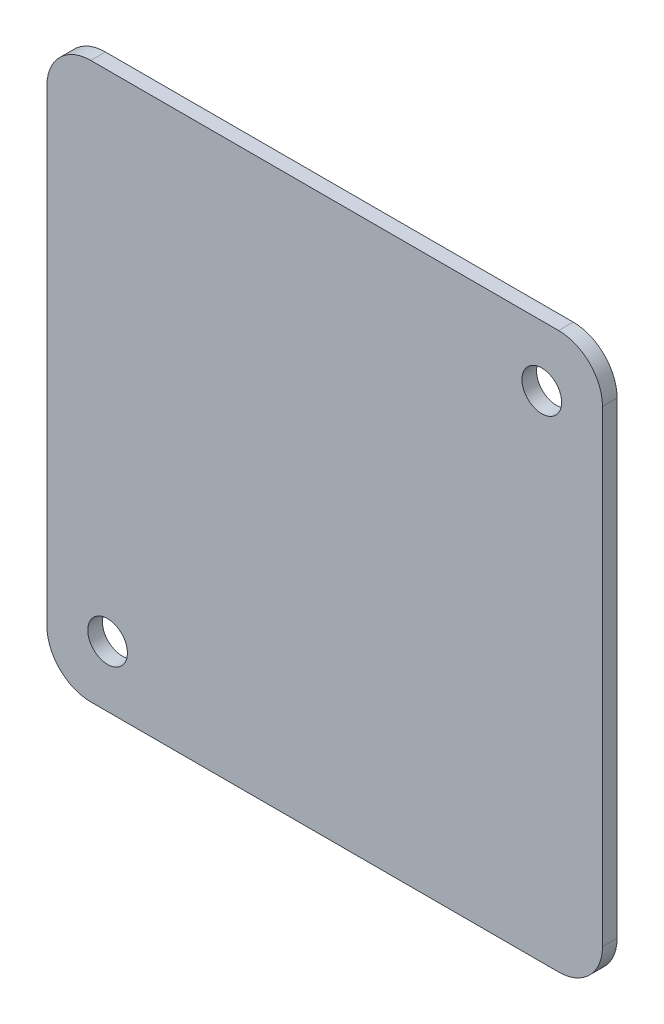
ISO-10303-21;
HEADER;
FILE_DESCRIPTION(('STEP AP214'),'2;1');
FILE_NAME('part.step','',(''),(''),'','','');
FILE_SCHEMA(('AUTOMOTIVE_DESIGN { 1 0 10303 214 1 1 1 1 }'));
ENDSEC;
DATA;
#1=APPLICATION_CONTEXT('core data for automotive mechanical design processes');
#2=APPLICATION_PROTOCOL_DEFINITION('international standard','automotive_design',2000,#1);
#3=PRODUCT_CONTEXT('',#1,'mechanical');
#4=PRODUCT('Part','Part','',(#3));
#5=PRODUCT_RELATED_PRODUCT_CATEGORY('part','',(#4));
#6=PRODUCT_DEFINITION_FORMATION('','',#4);
#7=PRODUCT_DEFINITION_CONTEXT('part definition',#1,'design');
#8=PRODUCT_DEFINITION('design','',#6,#7);
#9=PRODUCT_DEFINITION_SHAPE('','',#8);
#10=(LENGTH_UNIT() NAMED_UNIT(*) SI_UNIT(.MILLI.,.METRE.));
#11=(NAMED_UNIT(*) PLANE_ANGLE_UNIT() SI_UNIT($,.RADIAN.));
#12=(NAMED_UNIT(*) SI_UNIT($,.STERADIAN.) SOLID_ANGLE_UNIT());
#13=UNCERTAINTY_MEASURE_WITH_UNIT(LENGTH_MEASURE(1.E-05),#10,'distance_accuracy_value','');
#14=(GEOMETRIC_REPRESENTATION_CONTEXT(3) GLOBAL_UNCERTAINTY_ASSIGNED_CONTEXT((#13)) GLOBAL_UNIT_ASSIGNED_CONTEXT((#10,
#11,#12)) REPRESENTATION_CONTEXT('',''));
#15=CARTESIAN_POINT('',(0.,0.,0.));
#16=DIRECTION('',(0.,0.,1.));
#17=DIRECTION('',(1.,0.,0.));
#18=AXIS2_PLACEMENT_3D('',#15,#16,#17);
#19=CARTESIAN_POINT('',(-28.575,-87.0764341821135,-2.75335310107039E-11));
#20=DIRECTION('',(0.,0.,0.999999999999999));
#21=DIRECTION('',(1.,0.,0.));
#22=AXIS2_PLACEMENT_3D('',#19,#20,#21);
#23=PLANE('',#22);
#24=CARTESIAN_POINT('',(-30.4018276821934,-38.1032618642974,-1.06581410364015E-11));
#25=DIRECTION('',(0.,0.,-0.999999999999999));
#26=DIRECTION('',(-1.,0.,0.));
#27=AXIS2_PLACEMENT_3D('',#24,#25,#26);
#28=CIRCLE('',#27,2.15265);
#29=CARTESIAN_POINT('',(-32.5544776821934,-38.1032618642974,-1.06568265795248E-11));
#30=VERTEX_POINT('',#29);
#31=EDGE_CURVE('E197',#30,#30,#28,.T.);
#32=ORIENTED_EDGE('',*,*,#31,.T.);
#33=EDGE_LOOP('',(#32));
#34=FACE_BOUND('',#33,.T.);
#35=CARTESIAN_POINT('',(-28.575,-87.0764341821135,-2.75335310107039E-11));
#36=DIRECTION('',(0.,0.,0.999999999999999));
#37=DIRECTION('',(1.,0.,0.));
#38=AXIS2_PLACEMENT_3D('',#35,#36,#37);
#39=CIRCLE('',#38,4.76249999999999);
#40=CARTESIAN_POINT('',(-28.5749999999999,-91.8389341821095,-1.77635683940025E-11));
#41=VERTEX_POINT('',#40);
#42=CARTESIAN_POINT('',(-23.8125,-87.0764341821135,-2.75335310107039E-11));
#43=VERTEX_POINT('',#42);
#44=EDGE_CURVE('E135',#41,#43,#39,.T.);
#45=ORIENTED_EDGE('',*,*,#44,.T.);
#46=DIRECTION('',(0.,1.,0.));
#47=VECTOR('',#46,1.);
#48=CARTESIAN_POINT('',(-23.8125,-87.0764341821135,-2.75335310107039E-11));
#49=LINE('',#48,#47);
#50=CARTESIAN_POINT('',(-23.8125,-36.2764341821,0.));
#51=VERTEX_POINT('',#50);
#52=EDGE_CURVE('E138',#43,#51,#49,.T.);
#53=ORIENTED_EDGE('',*,*,#52,.T.);
#54=CARTESIAN_POINT('',(-28.575,-36.2764341821,0.));
#55=DIRECTION('',(0.,0.,0.999999999999999));
#56=DIRECTION('',(1.,0.,0.));
#57=AXIS2_PLACEMENT_3D('',#54,#55,#56);
#58=CIRCLE('',#57,4.7625);
#59=CARTESIAN_POINT('',(-28.5749999999999,-31.5139341821005,-8.88178419700125E-13));
#60=VERTEX_POINT('',#59);
#61=EDGE_CURVE('E142',#51,#60,#58,.T.);
#62=ORIENTED_EDGE('',*,*,#61,.T.);
#63=DIRECTION('',(-1.,0.,0.));
#64=VECTOR('',#63,1.);
#65=CARTESIAN_POINT('',(-28.5749999999999,-31.5139341821005,-8.88178419700125E-13));
#66=LINE('',#65,#64);
#67=CARTESIAN_POINT('',(-79.3749999999999,-31.5139341821005,-8.88178419700125E-13));
#68=VERTEX_POINT('',#67);
#69=EDGE_CURVE('E145',#60,#68,#66,.T.);
#70=ORIENTED_EDGE('',*,*,#69,.T.);
#71=CARTESIAN_POINT('',(-79.375,-36.2764341821,0.));
#72=DIRECTION('',(0.,0.,0.999999999999999));
#73=DIRECTION('',(1.,0.,0.));
#74=AXIS2_PLACEMENT_3D('',#71,#72,#73);
#75=CIRCLE('',#74,4.76249999999999);
#76=CARTESIAN_POINT('',(-84.1374999999999,-36.2764341821,0.));
#77=VERTEX_POINT('',#76);
#78=EDGE_CURVE('E148',#68,#77,#75,.T.);
#79=ORIENTED_EDGE('',*,*,#78,.T.);
#80=DIRECTION('',(0.,-0.999999999999999,0.));
#81=VECTOR('',#80,1.);
#82=CARTESIAN_POINT('',(-84.1374999999999,-36.2764341821,0.));
#83=LINE('',#82,#81);
#84=CARTESIAN_POINT('',(-84.1374999999999,-87.0764341821135,-2.75335310107039E-11));
#85=VERTEX_POINT('',#84);
#86=EDGE_CURVE('E151',#77,#85,#83,.T.);
#87=ORIENTED_EDGE('',*,*,#86,.T.);
#88=CARTESIAN_POINT('',(-79.375,-87.0764341821135,-2.75335310107039E-11));
#89=DIRECTION('',(0.,0.,0.999999999999999));
#90=DIRECTION('',(1.,0.,0.));
#91=AXIS2_PLACEMENT_3D('',#88,#89,#90);
#92=CIRCLE('',#91,4.76249999999999);
#93=CARTESIAN_POINT('',(-79.375,-91.8389341821095,-1.77635683940025E-11));
#94=VERTEX_POINT('',#93);
#95=EDGE_CURVE('E112',#85,#94,#92,.T.);
#96=ORIENTED_EDGE('',*,*,#95,.T.);
#97=DIRECTION('',(1.,0.,0.));
#98=VECTOR('',#97,1.);
#99=CARTESIAN_POINT('',(-79.375,-91.8389341821095,-1.77635683940025E-11));
#100=LINE('',#99,#98);
#101=EDGE_CURVE('E154',#94,#41,#100,.T.);
#102=ORIENTED_EDGE('',*,*,#101,.T.);
#103=EDGE_LOOP('',(#45,#53,#62,#70,#79,#87,#96,#102));
#104=FACE_BOUND('',#103,.T.);
#105=CARTESIAN_POINT('',(-77.5481723178064,-85.2496064999073,-1.77635683940025E-12));
#106=DIRECTION('',(0.,0.,-0.999999999999999));
#107=DIRECTION('',(-1.,0.,0.));
#108=AXIS2_PLACEMENT_3D('',#105,#106,#107);
#109=CIRCLE('',#108,2.15265000000001);
#110=CARTESIAN_POINT('',(-79.7008223178064,-85.2496064999073,-1.77504238252357E-12));
#111=VERTEX_POINT('',#110);
#112=EDGE_CURVE('E139',#111,#111,#109,.T.);
#113=ORIENTED_EDGE('',*,*,#112,.T.);
#114=EDGE_LOOP('',(#113));
#115=FACE_BOUND('',#114,.T.);
#116=ADVANCED_FACE('F37',(#34,#104,#115),#23,.T.);
#117=CARTESIAN_POINT('',(-28.5749999999999,-87.0764341821011,-1.58750000000119));
#118=DIRECTION('',(0.,0.,0.999999999999999));
#119=DIRECTION('',(1.,0.,0.));
#120=AXIS2_PLACEMENT_3D('',#117,#118,#119);
#121=CYLINDRICAL_SURFACE('',#120,4.76249999999999);
#122=ORIENTED_EDGE('',*,*,#44,.F.);
#123=DIRECTION('',(0.,0.,0.999999999999999));
#124=VECTOR('',#123,1.);
#125=CARTESIAN_POINT('',(-28.575,-91.8389341821055,-1.58750000000651));
#126=LINE('',#125,#124);
#127=CARTESIAN_POINT('',(-28.575,-91.8389341821055,-1.58750000000651));
#128=VERTEX_POINT('',#127);
#129=EDGE_CURVE('E11',#128,#41,#126,.T.);
#130=ORIENTED_EDGE('',*,*,#129,.F.);
#131=CARTESIAN_POINT('',(-28.5749999999999,-87.0764341821011,-1.58750000000119));
#132=DIRECTION('',(0.,0.,0.999999999999999));
#133=DIRECTION('',(1.,0.,0.));
#134=AXIS2_PLACEMENT_3D('',#131,#132,#133);
#135=CIRCLE('',#134,4.76249999999999);
#136=CARTESIAN_POINT('',(-23.8125,-87.0764341821007,-1.58750000000119));
#137=VERTEX_POINT('',#136);
#138=EDGE_CURVE('E156',#128,#137,#135,.T.);
#139=ORIENTED_EDGE('',*,*,#138,.T.);
#140=DIRECTION('',(0.,0.,0.999999999999999));
#141=VECTOR('',#140,1.);
#142=CARTESIAN_POINT('',(-23.8125,-87.0764341821007,-1.58750000000119));
#143=LINE('',#142,#141);
#144=EDGE_CURVE('E41',#137,#43,#143,.T.);
#145=ORIENTED_EDGE('',*,*,#144,.T.);
#146=EDGE_LOOP('',(#122,#130,#139,#145));
#147=FACE_BOUND('',#146,.T.);
#148=ADVANCED_FACE('F39',(#147),#121,.T.);
#149=CARTESIAN_POINT('',(-79.375,-91.8389341821051,-1.58750000000651));
#150=DIRECTION('',(0.,-1.,0.));
#151=DIRECTION('',(0.,0.,-0.999999999999999));
#152=AXIS2_PLACEMENT_3D('',#149,#150,#151);
#153=PLANE('',#152);
#154=ORIENTED_EDGE('',*,*,#101,.F.);
#155=DIRECTION('',(0.,0.,0.999999999999999));
#156=VECTOR('',#155,1.);
#157=CARTESIAN_POINT('',(-79.375,-91.8389341821051,-1.58750000000651));
#158=LINE('',#157,#156);
#159=CARTESIAN_POINT('',(-79.375,-91.8389341821051,-1.58750000000651));
#160=VERTEX_POINT('',#159);
#161=EDGE_CURVE('E47',#160,#94,#158,.T.);
#162=ORIENTED_EDGE('',*,*,#161,.F.);
#163=DIRECTION('',(1.,0.,0.));
#164=VECTOR('',#163,1.);
#165=CARTESIAN_POINT('',(-79.375,-91.8389341821051,-1.58750000000651));
#166=LINE('',#165,#164);
#167=EDGE_CURVE('E125',#160,#128,#166,.T.);
#168=ORIENTED_EDGE('',*,*,#167,.T.);
#169=ORIENTED_EDGE('',*,*,#129,.T.);
#170=EDGE_LOOP('',(#154,#162,#168,#169));
#171=FACE_BOUND('',#170,.T.);
#172=ADVANCED_FACE('F168',(#171),#153,.T.);
#173=CARTESIAN_POINT('',(-79.3749999999999,-87.0764341821007,-1.58750000000119));
#174=DIRECTION('',(0.,0.,0.999999999999999));
#175=DIRECTION('',(1.,0.,0.));
#176=AXIS2_PLACEMENT_3D('',#173,#174,#175);
#177=CYLINDRICAL_SURFACE('',#176,4.76249999999999);
#178=ORIENTED_EDGE('',*,*,#95,.F.);
#179=DIRECTION('',(0.,0.,0.999999999999999));
#180=VECTOR('',#179,1.);
#181=CARTESIAN_POINT('',(-84.1375,-87.0764341821007,-1.58750000000119));
#182=LINE('',#181,#180);
#183=CARTESIAN_POINT('',(-84.1375,-87.0764341821007,-1.58750000000119));
#184=VERTEX_POINT('',#183);
#185=EDGE_CURVE('E107',#184,#85,#182,.T.);
#186=ORIENTED_EDGE('',*,*,#185,.F.);
#187=CARTESIAN_POINT('',(-79.3749999999999,-87.0764341821007,-1.58750000000119));
#188=DIRECTION('',(0.,0.,0.999999999999999));
#189=DIRECTION('',(1.,0.,0.));
#190=AXIS2_PLACEMENT_3D('',#187,#188,#189);
#191=CIRCLE('',#190,4.76249999999999);
#192=EDGE_CURVE('E110',#184,#160,#191,.T.);
#193=ORIENTED_EDGE('',*,*,#192,.T.);
#194=ORIENTED_EDGE('',*,*,#161,.T.);
#195=EDGE_LOOP('',(#178,#186,#193,#194));
#196=FACE_BOUND('',#195,.T.);
#197=ADVANCED_FACE('F109',(#196),#177,.T.);
#198=CARTESIAN_POINT('',(-84.1374999999999,-36.2764341821036,-1.58750000000829));
#199=DIRECTION('',(-1.,0.,0.));
#200=DIRECTION('',(0.,0.,0.999999999999999));
#201=AXIS2_PLACEMENT_3D('',#198,#199,#200);
#202=PLANE('',#201);
#203=ORIENTED_EDGE('',*,*,#86,.F.);
#204=DIRECTION('',(0.,0.,0.999999999999999));
#205=VECTOR('',#204,1.);
#206=CARTESIAN_POINT('',(-84.1374999999999,-36.2764341821036,-1.58750000000829));
#207=LINE('',#206,#205);
#208=CARTESIAN_POINT('',(-84.1374999999999,-36.2764341821036,-1.58750000000829));
#209=VERTEX_POINT('',#208);
#210=EDGE_CURVE('E117',#209,#77,#207,.T.);
#211=ORIENTED_EDGE('',*,*,#210,.F.);
#212=DIRECTION('',(0.,-0.999999999999999,0.));
#213=VECTOR('',#212,1.);
#214=CARTESIAN_POINT('',(-84.1374999999999,-36.2764341821036,-1.58750000000829));
#215=LINE('',#214,#213);
#216=EDGE_CURVE('E123',#209,#184,#215,.T.);
#217=ORIENTED_EDGE('',*,*,#216,.T.);
#218=ORIENTED_EDGE('',*,*,#185,.T.);
#219=EDGE_LOOP('',(#203,#211,#217,#218));
#220=FACE_BOUND('',#219,.T.);
#221=ADVANCED_FACE('F127',(#220),#202,.T.);
#222=CARTESIAN_POINT('',(-79.3749999999999,-36.2764341821036,-1.58750000000829));
#223=DIRECTION('',(0.,0.,0.999999999999999));
#224=DIRECTION('',(1.,0.,0.));
#225=AXIS2_PLACEMENT_3D('',#222,#223,#224);
#226=CYLINDRICAL_SURFACE('',#225,4.76249999999999);
#227=ORIENTED_EDGE('',*,*,#78,.F.);
#228=DIRECTION('',(0.,0.,0.999999999999999));
#229=VECTOR('',#228,1.);
#230=CARTESIAN_POINT('',(-79.3749999999999,-31.5139341821067,-1.58750000001895));
#231=LINE('',#230,#229);
#232=CARTESIAN_POINT('',(-79.3749999999999,-31.5139341821067,-1.58750000001895));
#233=VERTEX_POINT('',#232);
#234=EDGE_CURVE('E160',#233,#68,#231,.T.);
#235=ORIENTED_EDGE('',*,*,#234,.F.);
#236=CARTESIAN_POINT('',(-79.3749999999999,-36.2764341821036,-1.58750000000829));
#237=DIRECTION('',(0.,0.,0.999999999999999));
#238=DIRECTION('',(1.,0.,0.));
#239=AXIS2_PLACEMENT_3D('',#236,#237,#238);
#240=CIRCLE('',#239,4.76249999999999);
#241=EDGE_CURVE('E128',#233,#209,#240,.T.);
#242=ORIENTED_EDGE('',*,*,#241,.T.);
#243=ORIENTED_EDGE('',*,*,#210,.T.);
#244=EDGE_LOOP('',(#227,#235,#242,#243));
#245=FACE_BOUND('',#244,.T.);
#246=ADVANCED_FACE('F224',(#245),#226,.T.);
#247=CARTESIAN_POINT('',(-28.575,-31.5139341821067,-1.58750000001895));
#248=DIRECTION('',(0.,1.,0.));
#249=DIRECTION('',(0.,0.,0.999999999999999));
#250=AXIS2_PLACEMENT_3D('',#247,#248,#249);
#251=PLANE('',#250);
#252=ORIENTED_EDGE('',*,*,#69,.F.);
#253=DIRECTION('',(0.,0.,0.999999999999999));
#254=VECTOR('',#253,1.);
#255=CARTESIAN_POINT('',(-28.575,-31.5139341821067,-1.58750000001895));
#256=LINE('',#255,#254);
#257=CARTESIAN_POINT('',(-28.575,-31.5139341821067,-1.58750000001895));
#258=VERTEX_POINT('',#257);
#259=EDGE_CURVE('E162',#258,#60,#256,.T.);
#260=ORIENTED_EDGE('',*,*,#259,.F.);
#261=DIRECTION('',(-1.,0.,0.));
#262=VECTOR('',#261,1.);
#263=CARTESIAN_POINT('',(-28.575,-31.5139341821067,-1.58750000001895));
#264=LINE('',#263,#262);
#265=EDGE_CURVE('E130',#258,#233,#264,.T.);
#266=ORIENTED_EDGE('',*,*,#265,.T.);
#267=ORIENTED_EDGE('',*,*,#234,.T.);
#268=EDGE_LOOP('',(#252,#260,#266,#267));
#269=FACE_BOUND('',#268,.T.);
#270=ADVANCED_FACE('F218',(#269),#251,.T.);
#271=CARTESIAN_POINT('',(-28.575,-36.2764341821036,-1.58750000000829));
#272=DIRECTION('',(0.,0.,0.999999999999999));
#273=DIRECTION('',(1.,0.,0.));
#274=AXIS2_PLACEMENT_3D('',#271,#272,#273);
#275=CYLINDRICAL_SURFACE('',#274,4.7625);
#276=ORIENTED_EDGE('',*,*,#61,.F.);
#277=DIRECTION('',(0.,0.,0.999999999999999));
#278=VECTOR('',#277,1.);
#279=CARTESIAN_POINT('',(-23.8124999999999,-36.2764341821036,-1.58750000000829));
#280=LINE('',#279,#278);
#281=CARTESIAN_POINT('',(-23.8124999999999,-36.2764341821036,-1.58750000000829));
#282=VERTEX_POINT('',#281);
#283=EDGE_CURVE('E163',#282,#51,#280,.T.);
#284=ORIENTED_EDGE('',*,*,#283,.F.);
#285=CARTESIAN_POINT('',(-28.575,-36.2764341821036,-1.58750000000829));
#286=DIRECTION('',(0.,0.,0.999999999999999));
#287=DIRECTION('',(1.,0.,0.));
#288=AXIS2_PLACEMENT_3D('',#285,#286,#287);
#289=CIRCLE('',#288,4.7625);
#290=EDGE_CURVE('E212',#282,#258,#289,.T.);
#291=ORIENTED_EDGE('',*,*,#290,.T.);
#292=ORIENTED_EDGE('',*,*,#259,.T.);
#293=EDGE_LOOP('',(#276,#284,#291,#292));
#294=FACE_BOUND('',#293,.T.);
#295=ADVANCED_FACE('F222',(#294),#275,.T.);
#296=CARTESIAN_POINT('',(-23.8125,-87.0764341821007,-1.58750000000119));
#297=DIRECTION('',(1.,0.,0.));
#298=DIRECTION('',(0.,1.,0.));
#299=AXIS2_PLACEMENT_3D('',#296,#297,#298);
#300=PLANE('',#299);
#301=ORIENTED_EDGE('',*,*,#52,.F.);
#302=ORIENTED_EDGE('',*,*,#144,.F.);
#303=DIRECTION('',(0.,1.,0.));
#304=VECTOR('',#303,1.);
#305=CARTESIAN_POINT('',(-23.8125,-87.0764341821007,-1.58750000000119));
#306=LINE('',#305,#304);
#307=EDGE_CURVE('E210',#137,#282,#306,.T.);
#308=ORIENTED_EDGE('',*,*,#307,.T.);
#309=ORIENTED_EDGE('',*,*,#283,.T.);
#310=EDGE_LOOP('',(#301,#302,#308,#309));
#311=FACE_BOUND('',#310,.T.);
#312=ADVANCED_FACE('F165',(#311),#300,.T.);
#313=CARTESIAN_POINT('',(-28.5749999999999,-87.0764341821011,-1.58750000000119));
#314=DIRECTION('',(0.,0.,0.999999999999999));
#315=DIRECTION('',(1.,0.,0.));
#316=AXIS2_PLACEMENT_3D('',#313,#314,#315);
#317=PLANE('',#316);
#318=CARTESIAN_POINT('',(-30.4018276821934,-38.1032618642942,-1.5875000000003));
#319=DIRECTION('',(0.,0.,-0.999999999999999));
#320=DIRECTION('',(-1.,0.,0.));
#321=AXIS2_PLACEMENT_3D('',#318,#319,#320);
#322=CIRCLE('',#321,2.15264999999999);
#323=CARTESIAN_POINT('',(-32.5544776821934,-38.1032618642942,-1.5875000000003));
#324=VERTEX_POINT('',#323);
#325=EDGE_CURVE('E200',#324,#324,#322,.T.);
#326=ORIENTED_EDGE('',*,*,#325,.F.);
#327=EDGE_LOOP('',(#326));
#328=FACE_BOUND('',#327,.T.);
#329=CARTESIAN_POINT('',(-77.5481723178065,-85.2496064999117,-1.58750000000651));
#330=DIRECTION('',(0.,0.,-0.999999999999999));
#331=DIRECTION('',(-1.,0.,0.));
#332=AXIS2_PLACEMENT_3D('',#329,#330,#331);
#333=CIRCLE('',#332,2.15264999999999);
#334=CARTESIAN_POINT('',(-79.7008223178065,-85.2496064999117,-1.58750000000651));
#335=VERTEX_POINT('',#334);
#336=EDGE_CURVE('E202',#335,#335,#333,.T.);
#337=ORIENTED_EDGE('',*,*,#336,.F.);
#338=EDGE_LOOP('',(#337));
#339=FACE_BOUND('',#338,.T.);
#340=ORIENTED_EDGE('',*,*,#138,.F.);
#341=ORIENTED_EDGE('',*,*,#167,.F.);
#342=ORIENTED_EDGE('',*,*,#192,.F.);
#343=ORIENTED_EDGE('',*,*,#216,.F.);
#344=ORIENTED_EDGE('',*,*,#241,.F.);
#345=ORIENTED_EDGE('',*,*,#265,.F.);
#346=ORIENTED_EDGE('',*,*,#290,.F.);
#347=ORIENTED_EDGE('',*,*,#307,.F.);
#348=EDGE_LOOP('',(#340,#341,#342,#343,#344,#345,#346,#347));
#349=FACE_BOUND('',#348,.T.);
#350=ADVANCED_FACE('F121',(#328,#339,#349),#317,.F.);
#351=CARTESIAN_POINT('',(-77.5481723178065,-85.2496064999117,-1.58750000000651));
#352=DIRECTION('',(0.,0.,-0.999999999999999));
#353=DIRECTION('',(-1.,0.,0.));
#354=AXIS2_PLACEMENT_3D('',#351,#352,#353);
#355=CYLINDRICAL_SURFACE('',#354,2.15265);
#356=ORIENTED_EDGE('',*,*,#112,.F.);
#357=EDGE_LOOP('',(#356));
#358=FACE_BOUND('',#357,.T.);
#359=ORIENTED_EDGE('',*,*,#336,.T.);
#360=EDGE_LOOP('',(#359));
#361=FACE_BOUND('',#360,.T.);
#362=ADVANCED_FACE('F185',(#358,#361),#355,.F.);
#363=CARTESIAN_POINT('',(-30.4018276821934,-38.1032618642942,-1.5875000000003));
#364=DIRECTION('',(0.,0.,-0.999999999999999));
#365=DIRECTION('',(-1.,0.,0.));
#366=AXIS2_PLACEMENT_3D('',#363,#364,#365);
#367=CYLINDRICAL_SURFACE('',#366,2.15264999999999);
#368=ORIENTED_EDGE('',*,*,#31,.F.);
#369=EDGE_LOOP('',(#368));
#370=FACE_BOUND('',#369,.T.);
#371=ORIENTED_EDGE('',*,*,#325,.T.);
#372=EDGE_LOOP('',(#371));
#373=FACE_BOUND('',#372,.T.);
#374=ADVANCED_FACE('F189',(#370,#373),#367,.F.);
#375=CLOSED_SHELL('',(#116,#148,#172,#197,#221,#246,#270,#295,#312,#350,#362,#374));
#376=MANIFOLD_SOLID_BREP('B2',#375);
#377=ADVANCED_BREP_SHAPE_REPRESENTATION('',(#18,#376),#14);
#378=SHAPE_DEFINITION_REPRESENTATION(#9,#377);
ENDSEC;
END-ISO-10303-21;
